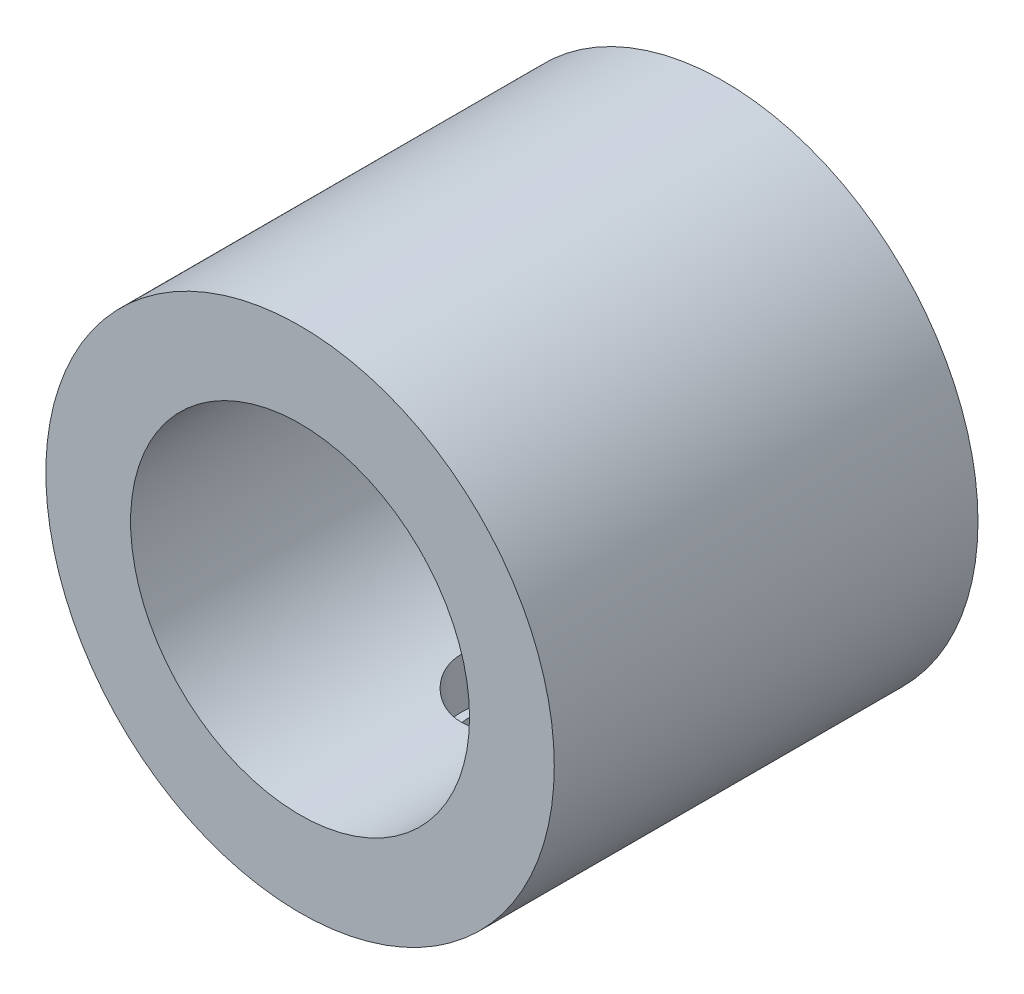
ISO-10303-21;
HEADER;
FILE_DESCRIPTION(('STEP AP214'),'2;1');
FILE_NAME('part.step','',(''),(''),'','','');
FILE_SCHEMA(('AUTOMOTIVE_DESIGN { 1 0 10303 214 1 1 1 1 }'));
ENDSEC;
DATA;
#1=APPLICATION_CONTEXT('core data for automotive mechanical design processes');
#2=APPLICATION_PROTOCOL_DEFINITION('international standard','automotive_design',2000,#1);
#3=PRODUCT_CONTEXT('',#1,'mechanical');
#4=PRODUCT('Part','Part','',(#3));
#5=PRODUCT_RELATED_PRODUCT_CATEGORY('part','',(#4));
#6=PRODUCT_DEFINITION_FORMATION('','',#4);
#7=PRODUCT_DEFINITION_CONTEXT('part definition',#1,'design');
#8=PRODUCT_DEFINITION('design','',#6,#7);
#9=PRODUCT_DEFINITION_SHAPE('','',#8);
#10=(LENGTH_UNIT() NAMED_UNIT(*) SI_UNIT(.MILLI.,.METRE.));
#11=(NAMED_UNIT(*) PLANE_ANGLE_UNIT() SI_UNIT($,.RADIAN.));
#12=(NAMED_UNIT(*) SI_UNIT($,.STERADIAN.) SOLID_ANGLE_UNIT());
#13=UNCERTAINTY_MEASURE_WITH_UNIT(LENGTH_MEASURE(1.E-05),#10,'distance_accuracy_value','');
#14=(GEOMETRIC_REPRESENTATION_CONTEXT(3) GLOBAL_UNCERTAINTY_ASSIGNED_CONTEXT((#13)) GLOBAL_UNIT_ASSIGNED_CONTEXT((#10,
#11,#12)) REPRESENTATION_CONTEXT('',''));
#15=CARTESIAN_POINT('',(0.,0.,0.));
#16=DIRECTION('',(0.,0.,1.));
#17=DIRECTION('',(1.,0.,0.));
#18=AXIS2_PLACEMENT_3D('',#15,#16,#17);
#19=CARTESIAN_POINT('',(0.,-5.,2.5));
#20=DIRECTION('',(0.,1.,0.));
#21=DIRECTION('',(0.,0.,1.));
#22=AXIS2_PLACEMENT_3D('',#19,#20,#21);
#23=CYLINDRICAL_SURFACE('',#22,0.5);
#24=CARTESIAN_POINT('',(0.,-3.,3.));
#25=CARTESIAN_POINT('',(0.0278781809916438,-2.99999952233765,2.99999888221044));
#26=CARTESIAN_POINT('',(0.055771576367765,-2.99960735582607,2.99766054500622));
#27=CARTESIAN_POINT('',(0.110776044334609,-2.99808068988278,2.98837286824694));
#28=CARTESIAN_POINT('',(0.13788637359185,-2.99694550784778,2.98141928861768));
#29=CARTESIAN_POINT('',(0.190520949442529,-2.9940601364729,2.96311691028145));
#30=CARTESIAN_POINT('',(0.216046473686381,-2.99231045031839,2.95177170687189));
#31=CARTESIAN_POINT('',(0.26482836839559,-2.98838845416414,2.92501754158952));
#32=CARTESIAN_POINT('',(0.288084997975719,-2.98621619250887,2.9096090445034));
#33=CARTESIAN_POINT('',(0.331894522858337,-2.98166663491663,2.87500898323591));
#34=CARTESIAN_POINT('',(0.352422580706994,-2.97928774362971,2.85578617707277));
#35=CARTESIAN_POINT('',(0.389977699731986,-2.97460525375346,2.81417040630544));
#36=CARTESIAN_POINT('',(0.407004539878195,-2.97230165992534,2.79177724170868));
#37=CARTESIAN_POINT('',(0.437173425121028,-2.96801513151956,2.74428580676059));
#38=CARTESIAN_POINT('',(0.450290910572201,-2.96603425818327,2.71917173263905));
#39=CARTESIAN_POINT('',(0.472111673082245,-2.96263957958935,2.66705808713988));
#40=CARTESIAN_POINT('',(0.480815248313123,-2.96122573602862,2.64005864326447));
#41=CARTESIAN_POINT('',(0.493482875556962,-2.95914107368551,2.58520394502869));
#42=CARTESIAN_POINT('',(0.497489805827081,-2.9584635369714,2.55735885269972));
#43=CARTESIAN_POINT('',(0.500783345057976,-2.9579078778733,2.50138394462331));
#44=CARTESIAN_POINT('',(0.5000702880778,-2.95802969891443,2.47325414916654));
#45=CARTESIAN_POINT('',(0.493979019679231,-2.95905285772711,2.41781442774491));
#46=CARTESIAN_POINT('',(0.488648976377955,-2.95994614663783,2.39049903929095));
#47=CARTESIAN_POINT('',(0.47355062808069,-2.96239899042202,2.33715573643417));
#48=CARTESIAN_POINT('',(0.463782170863949,-2.96395856814654,2.31112786622229));
#49=CARTESIAN_POINT('',(0.440035449218783,-2.9675769586682,2.26095423531182));
#50=CARTESIAN_POINT('',(0.426037182775943,-2.96963813421465,2.23681811878376));
#51=CARTESIAN_POINT('',(0.394242403511487,-2.97402583683002,2.19121911989232));
#52=CARTESIAN_POINT('',(0.376445584130858,-2.97635238530857,2.16975645350901));
#53=CARTESIAN_POINT('',(0.337296442431811,-2.98104405575957,2.12983478283853));
#54=CARTESIAN_POINT('',(0.315902792774626,-2.9834092984633,2.11141629629198));
#55=CARTESIAN_POINT('',(0.27030704979633,-2.98788520279345,2.07842444746693));
#56=CARTESIAN_POINT('',(0.246104938381285,-2.98999586277949,2.06385110996335));
#57=CARTESIAN_POINT('',(0.195541183233343,-2.99372778578582,2.03895955457274));
#58=CARTESIAN_POINT('',(0.169177745112933,-2.99534863681489,2.02864491613375));
#59=CARTESIAN_POINT('',(0.115059669120547,-2.99791500602532,2.0126011569508));
#60=CARTESIAN_POINT('',(0.0873051478358945,-2.99886058070095,2.00687165260526));
#61=CARTESIAN_POINT('',(0.0315419802603256,-2.99996225968537,2.00021572830777));
#62=CARTESIAN_POINT('',(0.00354014743020316,-3.00012750602557,1.99923368563888));
#63=CARTESIAN_POINT('',(-0.0522279545779766,-2.99967494884234,2.00195226888562));
#64=CARTESIAN_POINT('',(-0.0799942327784068,-2.99905717544824,2.00565271462675));
#65=CARTESIAN_POINT('',(-0.134331235109352,-2.99711365387641,2.0175849698671));
#66=CARTESIAN_POINT('',(-0.160908173677075,-2.99579220960262,2.02578924167803));
#67=CARTESIAN_POINT('',(-0.212309376972087,-2.99258892891072,2.04646690363991));
#68=CARTESIAN_POINT('',(-0.237133543181943,-2.99070706102404,2.05894053352706));
#69=CARTESIAN_POINT('',(-0.284566137893791,-2.98656903260482,2.08793022493936));
#70=CARTESIAN_POINT('',(-0.307153050187429,-2.98430971177404,2.10448103123345));
#71=CARTESIAN_POINT('',(-0.349248717100537,-2.9796769347838,2.14110746307701));
#72=CARTESIAN_POINT('',(-0.368757247939316,-2.97730347034309,2.16118334465533));
#73=CARTESIAN_POINT('',(-0.404348555931599,-2.97268035047169,2.20453950961429));
#74=CARTESIAN_POINT('',(-0.420393752222742,-2.97043223227421,2.22785083310288));
#75=CARTESIAN_POINT('',(-0.448340462058996,-2.96634305955577,2.27687059382771));
#76=CARTESIAN_POINT('',(-0.460242106953964,-2.96450199213204,2.3025789550455));
#77=CARTESIAN_POINT('',(-0.479507666294629,-2.96144690739541,2.35555794656243));
#78=CARTESIAN_POINT('',(-0.486890286509588,-2.96023030862213,2.3828216190061));
#79=CARTESIAN_POINT('',(-0.496967090755655,-2.95855543367052,2.43822402584435));
#80=CARTESIAN_POINT('',(-0.499661682389233,-2.95809709156544,2.46636268394641));
#81=CARTESIAN_POINT('',(-0.50027457320947,-2.95799346616802,2.52234103319248));
#82=CARTESIAN_POINT('',(-0.498252027225036,-2.9583381130113,2.55018007571506));
#83=CARTESIAN_POINT('',(-0.489615967791369,-2.95977956290746,2.60511584961015));
#84=CARTESIAN_POINT('',(-0.483002469222494,-2.96087636352243,2.63221258338837));
#85=CARTESIAN_POINT('',(-0.465394897918979,-2.96369471256344,2.68487168745852));
#86=CARTESIAN_POINT('',(-0.454405918120088,-2.96541553443934,2.71043580201121));
#87=CARTESIAN_POINT('',(-0.428365400783181,-2.96928873784442,2.75936713383897));
#88=CARTESIAN_POINT('',(-0.413313661749712,-2.9714411407768,2.78273424207443));
#89=CARTESIAN_POINT('',(-0.37936377687443,-2.97596690809124,2.82690711662155));
#90=CARTESIAN_POINT('',(-0.360422112718729,-2.97834259115261,2.84767920334005));
#91=CARTESIAN_POINT('',(-0.319321806276045,-2.98302874472168,2.88577032089499));
#92=CARTESIAN_POINT('',(-0.297162422582527,-2.98533920005309,2.90308855372763));
#93=CARTESIAN_POINT('',(-0.250073833928056,-2.98965305928444,2.93388965363999));
#94=CARTESIAN_POINT('',(-0.225126557506563,-2.99165423250621,2.94734520786259));
#95=CARTESIAN_POINT('',(-0.173302613875795,-2.99510233520355,2.96985389692198));
#96=CARTESIAN_POINT('',(-0.146427898966001,-2.99654981635496,2.97891141621594));
#97=CARTESIAN_POINT('',(-0.0995406620090791,-2.99841158166591,2.99040105482533));
#98=CARTESIAN_POINT('',(-0.0798117660596885,-2.99900405454672,2.99399489392319));
#99=CARTESIAN_POINT('',(-0.0400578620639609,-2.99979843197224,2.99879474756895));
#100=CARTESIAN_POINT('',(-0.0200328591216979,-3.00000034324128,3.00000080322747));
#101=CARTESIAN_POINT('',(0.,-3.,3.));
#102=B_SPLINE_CURVE_WITH_KNOTS('',3,(#24,#25,#26,#27,#28,#29,#30,#31,#32,#33,#34,#35,#36,#37,
#38,#39,#40,#41,#42,#43,#44,#45,#46,#47,#48,#49,#50,#51,#52,#53,#54,#55,#56,#57,#58,#59,#60,#61,
#62,#63,#64,#65,#66,#67,#68,#69,#70,#71,#72,#73,#74,#75,#76,#77,#78,#79,#80,#81,#82,#83,#84,#85,
#86,#87,#88,#89,#90,#91,#92,#93,#94,#95,#96,#97,#98,#99,#100,#101),.UNSPECIFIED.,.T.,.F.,(4,2,2,
2,2,2,2,2,2,2,2,2,2,2,2,2,2,2,2,2,2,2,2,2,2,2,2,2,2,2,2,2,2,2,2,2,2,2,4),(0.,0.0835613169877019,
0.167199509139084,0.250769373405054,0.334329682534958,0.418604982124664,0.502885600339714,
0.58768504164768,0.672478753752362,0.756492154206847,0.840499608641773,0.923641043520817,
1.00678533005076,1.09032911326512,1.17387964136115,1.25846553982265,1.3430519832717,
1.42770937783181,1.5123596890423,1.59601576698279,1.67966862607172,1.76281561401283,
1.84596727165213,1.92985365125405,2.01374612610857,2.09850764401524,2.18326647475189,
2.26767204468354,2.35207027557324,2.4354158190454,2.51876109237627,2.60200963645245,
2.68526231005867,2.76950276838678,2.85376266775795,2.9386044632144,3.02336150426014,
3.08340849632804,3.14345445455394),.UNSPECIFIED.);
#103=CARTESIAN_POINT('',(0.,-3.,3.));
#104=VERTEX_POINT('',#103);
#105=EDGE_CURVE('E58',#104,#104,#102,.T.);
#106=ORIENTED_EDGE('',*,*,#105,.F.);
#107=EDGE_LOOP('',(#106));
#108=FACE_BOUND('',#107,.T.);
#109=CARTESIAN_POINT('',(0.,-2.5,2.5));
#110=DIRECTION('',(0.,1.,0.));
#111=DIRECTION('',(0.,0.,1.));
#112=AXIS2_PLACEMENT_3D('',#109,#110,#111);
#113=CIRCLE('',#112,0.5);
#114=CARTESIAN_POINT('',(0.,-2.5,3.));
#115=VERTEX_POINT('',#114);
#116=EDGE_CURVE('E52',#115,#115,#113,.F.);
#117=ORIENTED_EDGE('',*,*,#116,.F.);
#118=EDGE_LOOP('',(#117));
#119=FACE_BOUND('',#118,.T.);
#120=ADVANCED_FACE('F29',(#108,#119),#23,.F.);
#121=CARTESIAN_POINT('',(0.,0.,5.));
#122=DIRECTION('',(0.,0.,1.));
#123=DIRECTION('',(1.,0.,0.));
#124=AXIS2_PLACEMENT_3D('',#121,#122,#123);
#125=PLANE('',#124);
#126=CARTESIAN_POINT('',(0.,0.,5.));
#127=DIRECTION('',(0.,0.,1.));
#128=DIRECTION('',(1.,0.,0.));
#129=AXIS2_PLACEMENT_3D('',#126,#127,#128);
#130=CIRCLE('',#129,3.);
#131=CARTESIAN_POINT('',(3.,0.,5.));
#132=VERTEX_POINT('',#131);
#133=EDGE_CURVE('E10',#132,#132,#130,.T.);
#134=ORIENTED_EDGE('',*,*,#133,.T.);
#135=EDGE_LOOP('',(#134));
#136=FACE_BOUND('',#135,.T.);
#137=CARTESIAN_POINT('',(0.,0.,5.));
#138=DIRECTION('',(0.,0.,1.));
#139=DIRECTION('',(1.,0.,0.));
#140=AXIS2_PLACEMENT_3D('',#137,#138,#139);
#141=CIRCLE('',#140,2.);
#142=CARTESIAN_POINT('',(2.,0.,5.));
#143=VERTEX_POINT('',#142);
#144=EDGE_CURVE('E47',#143,#143,#141,.T.);
#145=ORIENTED_EDGE('',*,*,#144,.F.);
#146=EDGE_LOOP('',(#145));
#147=FACE_BOUND('',#146,.T.);
#148=ADVANCED_FACE('F70',(#136,#147),#125,.T.);
#149=CARTESIAN_POINT('',(0.,0.,0.));
#150=DIRECTION('',(0.,0.,1.));
#151=DIRECTION('',(1.,0.,0.));
#152=AXIS2_PLACEMENT_3D('',#149,#150,#151);
#153=PLANE('',#152);
#154=CARTESIAN_POINT('',(0.,0.,0.));
#155=DIRECTION('',(0.,0.,1.));
#156=DIRECTION('',(1.,0.,0.));
#157=AXIS2_PLACEMENT_3D('',#154,#155,#156);
#158=CIRCLE('',#157,3.);
#159=CARTESIAN_POINT('',(3.,0.,0.));
#160=VERTEX_POINT('',#159);
#161=EDGE_CURVE('E42',#160,#160,#158,.T.);
#162=ORIENTED_EDGE('',*,*,#161,.F.);
#163=EDGE_LOOP('',(#162));
#164=FACE_BOUND('',#163,.T.);
#165=CARTESIAN_POINT('',(0.,0.,0.));
#166=DIRECTION('',(0.,0.,1.));
#167=DIRECTION('',(1.,0.,0.));
#168=AXIS2_PLACEMENT_3D('',#165,#166,#167);
#169=CIRCLE('',#168,2.);
#170=CARTESIAN_POINT('',(2.,0.,0.));
#171=VERTEX_POINT('',#170);
#172=EDGE_CURVE('E50',#171,#171,#169,.T.);
#173=ORIENTED_EDGE('',*,*,#172,.T.);
#174=EDGE_LOOP('',(#173));
#175=FACE_BOUND('',#174,.T.);
#176=ADVANCED_FACE('F82',(#164,#175),#153,.F.);
#177=CARTESIAN_POINT('',(0.,0.,5.));
#178=DIRECTION('',(0.,0.,-1.));
#179=DIRECTION('',(-1.,0.,0.));
#180=AXIS2_PLACEMENT_3D('',#177,#178,#179);
#181=CYLINDRICAL_SURFACE('',#180,3.);
#182=ORIENTED_EDGE('',*,*,#105,.T.);
#183=EDGE_LOOP('',(#182));
#184=FACE_BOUND('',#183,.T.);
#185=ORIENTED_EDGE('',*,*,#133,.F.);
#186=EDGE_LOOP('',(#185));
#187=FACE_BOUND('',#186,.T.);
#188=ORIENTED_EDGE('',*,*,#161,.T.);
#189=EDGE_LOOP('',(#188));
#190=FACE_BOUND('',#189,.T.);
#191=ADVANCED_FACE('F31',(#184,#187,#190),#181,.T.);
#192=CARTESIAN_POINT('',(0.,0.,5.));
#193=DIRECTION('',(0.,0.,-1.));
#194=DIRECTION('',(-1.,0.,0.));
#195=AXIS2_PLACEMENT_3D('',#192,#193,#194);
#196=CYLINDRICAL_SURFACE('',#195,2.);
#197=CARTESIAN_POINT('',(0.,-2.,3.1));
#198=CARTESIAN_POINT('',(0.0329154451013208,-1.9999997170022,3.09999960100605));
#199=CARTESIAN_POINT('',(0.0658349273406127,-1.99917966277583,3.09728245455041));
#200=CARTESIAN_POINT('',(0.130715250121953,-1.99598842237475,3.08651145831116));
#201=CARTESIAN_POINT('',(0.162675801764568,-1.99361677355871,3.07845601679067));
#202=CARTESIAN_POINT('',(0.224693083101812,-1.9875822100074,3.05730159323589));
#203=CARTESIAN_POINT('',(0.254752545758151,-1.98392120100191,3.04421005215242));
#204=CARTESIAN_POINT('',(0.312249672421252,-1.97568843695037,3.01338556277767));
#205=CARTESIAN_POINT('',(0.339686986987865,-1.97111656076748,2.99565199704186));
#206=CARTESIAN_POINT('',(0.391948718873503,-1.96140294877191,2.9555103970109));
#207=CARTESIAN_POINT('',(0.416687228497753,-1.9562495346312,2.93299334964552));
#208=CARTESIAN_POINT('',(0.46209968369328,-1.94602333683871,2.88415630803604));
#209=CARTESIAN_POINT('',(0.482772945309705,-1.94095056688659,2.85783567515044));
#210=CARTESIAN_POINT('',(0.519920150894891,-1.93133645598676,2.80141169878453));
#211=CARTESIAN_POINT('',(0.536289236089081,-1.92680962669952,2.77123661560208));
#212=CARTESIAN_POINT('',(0.563685579098816,-1.91897448153211,2.70840429830951));
#213=CARTESIAN_POINT('',(0.574714119679049,-1.91566587308889,2.67574766243487));
#214=CARTESIAN_POINT('',(0.590806534730253,-1.91076348351385,2.60984389354675));
#215=CARTESIAN_POINT('',(0.596028784940189,-1.90912427788711,2.57663890244258));
#216=CARTESIAN_POINT('',(0.600854922460318,-1.90761115958514,2.5097867374989));
#217=CARTESIAN_POINT('',(0.600460171044288,-1.90773681919679,2.47613967277019));
#218=CARTESIAN_POINT('',(0.594187908798803,-1.90969897612233,2.41064643655765));
#219=CARTESIAN_POINT('',(0.588508821050623,-1.91147355435668,2.37877909985539));
#220=CARTESIAN_POINT('',(0.572149681708343,-1.91643342495439,2.31647208549034));
#221=CARTESIAN_POINT('',(0.561469136566596,-1.91961885654016,2.28603254905019));
#222=CARTESIAN_POINT('',(0.535264106614695,-1.92709093228899,2.22695986013578));
#223=CARTESIAN_POINT('',(0.519675267738562,-1.93139206446088,2.19835716641792));
#224=CARTESIAN_POINT('',(0.484140890354743,-1.94060394800318,2.1441071911959));
#225=CARTESIAN_POINT('',(0.464194296010357,-1.94551484698876,2.11846062823448));
#226=CARTESIAN_POINT('',(0.419525163062184,-1.95564404519092,2.0697255236952));
#227=CARTESIAN_POINT('',(0.394637962986789,-1.96086661724177,2.04678853438813));
#228=CARTESIAN_POINT('',(0.341305303725588,-1.97084897625326,2.0053784063743));
#229=CARTESIAN_POINT('',(0.312859620744356,-1.9756087340737,1.98690554863423));
#230=CARTESIAN_POINT('',(0.252942015337122,-1.98417264027782,1.95485603101411));
#231=CARTESIAN_POINT('',(0.221451099899181,-1.98797017467324,1.94131299350006));
#232=CARTESIAN_POINT('',(0.156498166241409,-1.9941340873289,1.91976016396015));
#233=CARTESIAN_POINT('',(0.123036700635833,-1.996500864748,1.911748828587));
#234=CARTESIAN_POINT('',(0.0563808970673333,-1.99947345857415,1.90173912884024));
#235=CARTESIAN_POINT('',(0.0232200390404752,-2.00013940167117,1.89953536567936));
#236=CARTESIAN_POINT('',(-0.042999842329352,-1.99981169296703,1.90062766228483));
#237=CARTESIAN_POINT('',(-0.0760588786763101,-1.99881826271098,1.90392298786057));
#238=CARTESIAN_POINT('',(-0.140361442123879,-1.99532278794869,1.9157538444446));
#239=CARTESIAN_POINT('',(-0.171629109045671,-1.99285531919782,1.92416935503236));
#240=CARTESIAN_POINT('',(-0.232301855581803,-1.98669739136598,1.94585729311127));
#241=CARTESIAN_POINT('',(-0.261706710810216,-1.98300678528377,1.9591303044151));
#242=CARTESIAN_POINT('',(-0.318574875784437,-1.97467861740588,1.9905012661925));
#243=CARTESIAN_POINT('',(-0.34597753047993,-1.97002112332088,2.00870373637936));
#244=CARTESIAN_POINT('',(-0.397409323191995,-1.96029387505509,2.04928990162096));
#245=CARTESIAN_POINT('',(-0.421437612942137,-1.95522401771617,2.07167464475444));
#246=CARTESIAN_POINT('',(-0.466342978204351,-1.94501268748499,2.12095492334839));
#247=CARTESIAN_POINT('',(-0.487073924926942,-1.93987530016511,2.14798475031116));
#248=CARTESIAN_POINT('',(-0.523715980287684,-1.93030606092181,2.20525117560295));
#249=CARTESIAN_POINT('',(-0.539627215314415,-1.92587419049889,2.23548768981409));
#250=CARTESIAN_POINT('',(-0.566069388510892,-1.91826875857973,2.2982129965081));
#251=CARTESIAN_POINT('',(-0.576625387759088,-1.91508935181965,2.33069047464264));
#252=CARTESIAN_POINT('',(-0.592086923271643,-1.91036637789379,2.39707518760221));
#253=CARTESIAN_POINT('',(-0.596994395917993,-1.90882225014947,2.43098192832454));
#254=CARTESIAN_POINT('',(-0.600887937937675,-1.90759988987286,2.4977446073448));
#255=CARTESIAN_POINT('',(-0.600112221233273,-1.90784658974116,2.53058546040551));
#256=CARTESIAN_POINT('',(-0.593230021779938,-1.90999760518304,2.59564564135064));
#257=CARTESIAN_POINT('',(-0.587123752499046,-1.91190185437816,2.62786499407095));
#258=CARTESIAN_POINT('',(-0.569907555216363,-1.91710305467369,2.69037815965674));
#259=CARTESIAN_POINT('',(-0.558860702028224,-1.92038241818175,2.72069091494457));
#260=CARTESIAN_POINT('',(-0.532126028484564,-1.92796111563865,2.7790569755272));
#261=CARTESIAN_POINT('',(-0.516437319851517,-1.93226064477782,2.80710984705633));
#262=CARTESIAN_POINT('',(-0.480195055220273,-1.94159070570274,2.86126524661082));
#263=CARTESIAN_POINT('',(-0.45948510437197,-1.94664216065503,2.88725950450416));
#264=CARTESIAN_POINT('',(-0.41406973851913,-1.95680528180026,2.93548099932315));
#265=CARTESIAN_POINT('',(-0.3893632868538,-1.96191696329566,2.95770725578711));
#266=CARTESIAN_POINT('',(-0.335786304873297,-1.97180374628255,2.99840936491801));
#267=CARTESIAN_POINT('',(-0.306815154316242,-1.97656463906268,3.0167565787422));
#268=CARTESIAN_POINT('',(-0.246056549593411,-1.98504272182326,3.04829406796161));
#269=CARTESIAN_POINT('',(-0.214270421199581,-1.98876039972427,3.0614867553098));
#270=CARTESIAN_POINT('',(-0.152303085062111,-1.9944086998772,3.0811581102611));
#271=CARTESIAN_POINT('',(-0.122314784781693,-1.99648810952427,3.0882046691533));
#272=CARTESIAN_POINT('',(-0.0615520780923109,-1.99928377797797,3.09762541009663));
#273=CARTESIAN_POINT('',(-0.030777803943255,-2.00000026461896,3.10000037308193));
#274=CARTESIAN_POINT('',(0.,-2.,3.1));
#275=B_SPLINE_CURVE_WITH_KNOTS('',3,(#197,#198,#199,#200,#201,#202,#203,#204,#205,#206,#207,
#208,#209,#210,#211,#212,#213,#214,#215,#216,#217,#218,#219,#220,#221,#222,#223,#224,#225,#226,
#227,#228,#229,#230,#231,#232,#233,#234,#235,#236,#237,#238,#239,#240,#241,#242,#243,#244,#245,
#246,#247,#248,#249,#250,#251,#252,#253,#254,#255,#256,#257,#258,#259,#260,#261,#262,#263,#264,
#265,#266,#267,#268,#269,#270,#271,#272,#273,#274),.UNSPECIFIED.,.T.,.F.,(4,2,2,2,2,2,2,2,2,2,2,
2,2,2,2,2,2,2,2,2,2,2,2,2,2,2,2,2,2,2,2,2,2,2,2,2,2,2,4),(0.,0.0986332814450442,0.1972959859384,
0.29581347052035,0.394344065765081,0.495422411792766,0.596517749154532,0.699885924016436,
0.803229258172894,0.903678757411506,1.00410391324614,1.10090406676049,1.19771377460179,
1.29584970575826,1.39400944060401,1.49626841616245,1.59853382609407,1.70148418749654,
1.80440581408502,1.90363523772396,2.00285141417109,2.09982698669909,2.1968142183447,
2.29604522278142,2.39530112797055,2.49816160126106,2.60101937698051,2.7033912597652,
2.80572803779072,2.90380062181736,3.00186927859599,3.09872016156048,3.19558959016202,
3.29598770266931,3.3964118995396,3.49977198457627,3.60308364633053,3.69532676767143,
3.78755446774509),.UNSPECIFIED.);
#276=CARTESIAN_POINT('',(0.,-2.,3.1));
#277=VERTEX_POINT('',#276);
#278=EDGE_CURVE('E34',#277,#277,#275,.T.);
#279=ORIENTED_EDGE('',*,*,#278,.F.);
#280=EDGE_LOOP('',(#279));
#281=FACE_BOUND('',#280,.T.);
#282=ORIENTED_EDGE('',*,*,#144,.T.);
#283=EDGE_LOOP('',(#282));
#284=FACE_BOUND('',#283,.T.);
#285=ORIENTED_EDGE('',*,*,#172,.F.);
#286=EDGE_LOOP('',(#285));
#287=FACE_BOUND('',#286,.T.);
#288=ADVANCED_FACE('F75',(#281,#284,#287),#196,.F.);
#289=CARTESIAN_POINT('',(0.,-2.5,2.5));
#290=DIRECTION('',(0.,1.,0.));
#291=DIRECTION('',(0.,0.,1.));
#292=AXIS2_PLACEMENT_3D('',#289,#290,#291);
#293=PLANE('',#292);
#294=CARTESIAN_POINT('',(0.,-2.5,2.5));
#295=DIRECTION('',(0.,1.,0.));
#296=DIRECTION('',(0.,0.,1.));
#297=AXIS2_PLACEMENT_3D('',#294,#295,#296);
#298=CIRCLE('',#297,0.6);
#299=CARTESIAN_POINT('',(0.,-2.5,3.1));
#300=VERTEX_POINT('',#299);
#301=EDGE_CURVE('E54',#300,#300,#298,.T.);
#302=ORIENTED_EDGE('',*,*,#301,.T.);
#303=EDGE_LOOP('',(#302));
#304=FACE_BOUND('',#303,.T.);
#305=ORIENTED_EDGE('',*,*,#116,.T.);
#306=EDGE_LOOP('',(#305));
#307=FACE_BOUND('',#306,.T.);
#308=ADVANCED_FACE('F79',(#304,#307),#293,.T.);
#309=CARTESIAN_POINT('',(0.,-2.5,2.5));
#310=DIRECTION('',(0.,1.,0.));
#311=DIRECTION('',(0.,0.,1.));
#312=AXIS2_PLACEMENT_3D('',#309,#310,#311);
#313=CYLINDRICAL_SURFACE('',#312,0.6);
#314=ORIENTED_EDGE('',*,*,#278,.T.);
#315=EDGE_LOOP('',(#314));
#316=FACE_BOUND('',#315,.T.);
#317=ORIENTED_EDGE('',*,*,#301,.F.);
#318=EDGE_LOOP('',(#317));
#319=FACE_BOUND('',#318,.T.);
#320=ADVANCED_FACE('F72',(#316,#319),#313,.F.);
#321=CLOSED_SHELL('',(#120,#148,#176,#191,#288,#308,#320));
#322=MANIFOLD_SOLID_BREP('B2',#321);
#323=ADVANCED_BREP_SHAPE_REPRESENTATION('',(#18,#322),#14);
#324=SHAPE_DEFINITION_REPRESENTATION(#9,#323);
ENDSEC;
END-ISO-10303-21;
